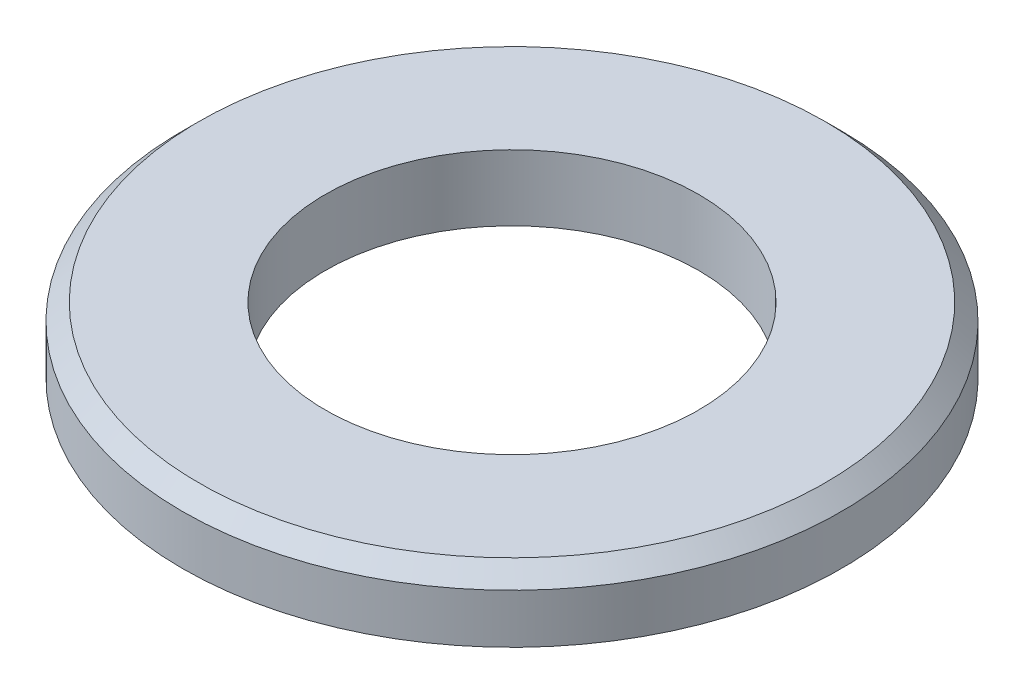
ISO-10303-21;
HEADER;
FILE_DESCRIPTION(('STEP AP214'),'2;1');
FILE_NAME('part.step','',(''),(''),'','','');
FILE_SCHEMA(('AUTOMOTIVE_DESIGN { 1 0 10303 214 1 1 1 1 }'));
ENDSEC;
DATA;
#1=APPLICATION_CONTEXT('core data for automotive mechanical design processes');
#2=APPLICATION_PROTOCOL_DEFINITION('international standard','automotive_design',2000,#1);
#3=PRODUCT_CONTEXT('',#1,'mechanical');
#4=PRODUCT('Part','Part','',(#3));
#5=PRODUCT_RELATED_PRODUCT_CATEGORY('part','',(#4));
#6=PRODUCT_DEFINITION_FORMATION('','',#4);
#7=PRODUCT_DEFINITION_CONTEXT('part definition',#1,'design');
#8=PRODUCT_DEFINITION('design','',#6,#7);
#9=PRODUCT_DEFINITION_SHAPE('','',#8);
#10=(LENGTH_UNIT() NAMED_UNIT(*) SI_UNIT(.MILLI.,.METRE.));
#11=(NAMED_UNIT(*) PLANE_ANGLE_UNIT() SI_UNIT($,.RADIAN.));
#12=(NAMED_UNIT(*) SI_UNIT($,.STERADIAN.) SOLID_ANGLE_UNIT());
#13=UNCERTAINTY_MEASURE_WITH_UNIT(LENGTH_MEASURE(1.E-05),#10,'distance_accuracy_value','');
#14=(GEOMETRIC_REPRESENTATION_CONTEXT(3) GLOBAL_UNCERTAINTY_ASSIGNED_CONTEXT((#13)) GLOBAL_UNIT_ASSIGNED_CONTEXT((#10,
#11,#12)) REPRESENTATION_CONTEXT('',''));
#15=CARTESIAN_POINT('',(0.,0.,0.));
#16=DIRECTION('',(0.,0.,1.));
#17=DIRECTION('',(1.,0.,0.));
#18=AXIS2_PLACEMENT_3D('',#15,#16,#17);
#19=CARTESIAN_POINT('',(0.,0.,0.));
#20=DIRECTION('',(0.,-1.,0.));
#21=DIRECTION('',(0.,0.,-1.));
#22=AXIS2_PLACEMENT_3D('',#19,#20,#21);
#23=CYLINDRICAL_SURFACE('',#22,8.5);
#24=CARTESIAN_POINT('',(0.,11.6445070422535,0.));
#25=DIRECTION('',(0.,-1.,0.));
#26=DIRECTION('',(0.,0.,-1.));
#27=AXIS2_PLACEMENT_3D('',#24,#25,#26);
#28=CIRCLE('',#27,8.5);
#29=CARTESIAN_POINT('',(0.,11.6445070422535,-8.5));
#30=VERTEX_POINT('',#29);
#31=EDGE_CURVE('E10',#30,#30,#28,.T.);
#32=ORIENTED_EDGE('',*,*,#31,.F.);
#33=EDGE_LOOP('',(#32));
#34=FACE_BOUND('',#33,.T.);
#35=CARTESIAN_POINT('',(0.,8.64450704225353,0.));
#36=DIRECTION('',(0.,-1.,0.));
#37=DIRECTION('',(0.,0.,-1.));
#38=AXIS2_PLACEMENT_3D('',#35,#36,#37);
#39=CIRCLE('',#38,8.5);
#40=CARTESIAN_POINT('',(0.,8.64450704225353,-8.5));
#41=VERTEX_POINT('',#40);
#42=EDGE_CURVE('E54',#41,#41,#39,.T.);
#43=ORIENTED_EDGE('',*,*,#42,.T.);
#44=EDGE_LOOP('',(#43));
#45=FACE_BOUND('',#44,.T.);
#46=ADVANCED_FACE('F35',(#34,#45),#23,.F.);
#47=CARTESIAN_POINT('',(-8.5,11.6445070422535,0.));
#48=DIRECTION('',(0.,-1.,0.));
#49=DIRECTION('',(0.,0.,-1.));
#50=AXIS2_PLACEMENT_3D('',#47,#48,#49);
#51=PLANE('',#50);
#52=CARTESIAN_POINT('',(0.,11.6445070422535,0.));
#53=DIRECTION('',(0.,-1.,0.));
#54=DIRECTION('',(0.,0.,-1.));
#55=AXIS2_PLACEMENT_3D('',#52,#53,#54);
#56=CIRCLE('',#55,14.25);
#57=CARTESIAN_POINT('',(0.,11.6445070422535,-14.25));
#58=VERTEX_POINT('',#57);
#59=EDGE_CURVE('E41',#58,#58,#56,.T.);
#60=ORIENTED_EDGE('',*,*,#59,.F.);
#61=EDGE_LOOP('',(#60));
#62=FACE_BOUND('',#61,.T.);
#63=ORIENTED_EDGE('',*,*,#31,.T.);
#64=EDGE_LOOP('',(#63));
#65=FACE_BOUND('',#64,.T.);
#66=ADVANCED_FACE('F73',(#62,#65),#51,.F.);
#67=CARTESIAN_POINT('',(0.,11.6445070422535,0.));
#68=DIRECTION('',(0.,-1.,0.));
#69=DIRECTION('',(0.,0.,-1.));
#70=AXIS2_PLACEMENT_3D('',#67,#68,#69);
#71=CONICAL_SURFACE('',#70,14.25,0.78539816339745);
#72=CARTESIAN_POINT('',(0.,10.8945070422535,0.));
#73=DIRECTION('',(0.,-1.,0.));
#74=DIRECTION('',(0.,0.,-1.));
#75=AXIS2_PLACEMENT_3D('',#72,#73,#74);
#76=CIRCLE('',#75,15.);
#77=CARTESIAN_POINT('',(0.,10.8945070422535,-15.));
#78=VERTEX_POINT('',#77);
#79=EDGE_CURVE('E45',#78,#78,#76,.T.);
#80=ORIENTED_EDGE('',*,*,#79,.F.);
#81=EDGE_LOOP('',(#80));
#82=FACE_BOUND('',#81,.T.);
#83=ORIENTED_EDGE('',*,*,#59,.T.);
#84=EDGE_LOOP('',(#83));
#85=FACE_BOUND('',#84,.T.);
#86=ADVANCED_FACE('F68',(#82,#85),#71,.T.);
#87=CARTESIAN_POINT('',(0.,0.,0.));
#88=DIRECTION('',(0.,-1.,0.));
#89=DIRECTION('',(0.,0.,-1.));
#90=AXIS2_PLACEMENT_3D('',#87,#88,#89);
#91=CYLINDRICAL_SURFACE('',#90,15.);
#92=CARTESIAN_POINT('',(0.,8.64450704225353,0.));
#93=DIRECTION('',(0.,-1.,0.));
#94=DIRECTION('',(0.,0.,-1.));
#95=AXIS2_PLACEMENT_3D('',#92,#93,#94);
#96=CIRCLE('',#95,15.);
#97=CARTESIAN_POINT('',(0.,8.64450704225353,-15.));
#98=VERTEX_POINT('',#97);
#99=EDGE_CURVE('E49',#98,#98,#96,.T.);
#100=ORIENTED_EDGE('',*,*,#99,.F.);
#101=EDGE_LOOP('',(#100));
#102=FACE_BOUND('',#101,.T.);
#103=ORIENTED_EDGE('',*,*,#79,.T.);
#104=EDGE_LOOP('',(#103));
#105=FACE_BOUND('',#104,.T.);
#106=ADVANCED_FACE('F62',(#102,#105),#91,.T.);
#107=CARTESIAN_POINT('',(-8.5,8.64450704225353,0.));
#108=DIRECTION('',(0.,1.,0.));
#109=DIRECTION('',(0.,0.,1.));
#110=AXIS2_PLACEMENT_3D('',#107,#108,#109);
#111=PLANE('',#110);
#112=ORIENTED_EDGE('',*,*,#42,.F.);
#113=EDGE_LOOP('',(#112));
#114=FACE_BOUND('',#113,.T.);
#115=ORIENTED_EDGE('',*,*,#99,.T.);
#116=EDGE_LOOP('',(#115));
#117=FACE_BOUND('',#116,.T.);
#118=ADVANCED_FACE('F59',(#114,#117),#111,.F.);
#119=CLOSED_SHELL('',(#46,#66,#86,#106,#118));
#120=MANIFOLD_SOLID_BREP('B2',#119);
#121=ADVANCED_BREP_SHAPE_REPRESENTATION('',(#18,#120),#14);
#122=SHAPE_DEFINITION_REPRESENTATION(#9,#121);
ENDSEC;
END-ISO-10303-21;
